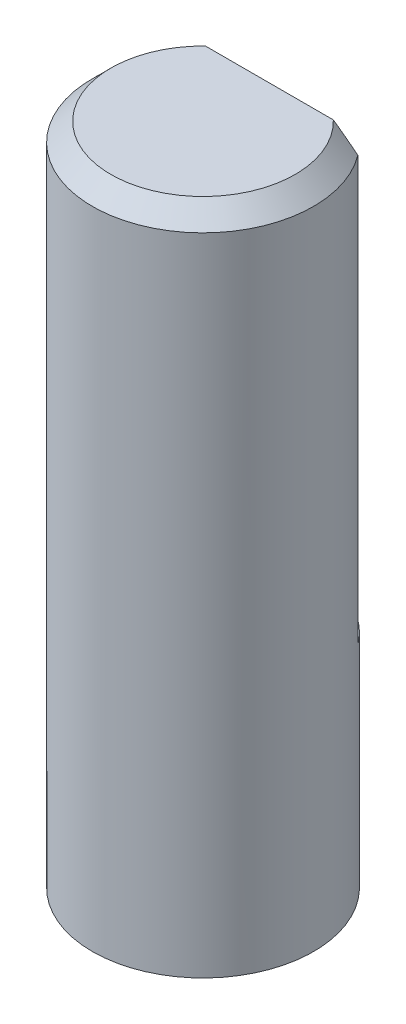
ISO-10303-21;
HEADER;
FILE_DESCRIPTION(('STEP AP214'),'2;1');
FILE_NAME('part.step','',(''),(''),'','','');
FILE_SCHEMA(('AUTOMOTIVE_DESIGN { 1 0 10303 214 1 1 1 1 }'));
ENDSEC;
DATA;
#1=APPLICATION_CONTEXT('core data for automotive mechanical design processes');
#2=APPLICATION_PROTOCOL_DEFINITION('international standard','automotive_design',2000,#1);
#3=PRODUCT_CONTEXT('',#1,'mechanical');
#4=PRODUCT('Part','Part','',(#3));
#5=PRODUCT_RELATED_PRODUCT_CATEGORY('part','',(#4));
#6=PRODUCT_DEFINITION_FORMATION('','',#4);
#7=PRODUCT_DEFINITION_CONTEXT('part definition',#1,'design');
#8=PRODUCT_DEFINITION('design','',#6,#7);
#9=PRODUCT_DEFINITION_SHAPE('','',#8);
#10=(LENGTH_UNIT() NAMED_UNIT(*) SI_UNIT(.MILLI.,.METRE.));
#11=(NAMED_UNIT(*) PLANE_ANGLE_UNIT() SI_UNIT($,.RADIAN.));
#12=(NAMED_UNIT(*) SI_UNIT($,.STERADIAN.) SOLID_ANGLE_UNIT());
#13=UNCERTAINTY_MEASURE_WITH_UNIT(LENGTH_MEASURE(1.E-05),#10,'distance_accuracy_value','');
#14=(GEOMETRIC_REPRESENTATION_CONTEXT(3) GLOBAL_UNCERTAINTY_ASSIGNED_CONTEXT((#13)) GLOBAL_UNIT_ASSIGNED_CONTEXT((#10,
#11,#12)) REPRESENTATION_CONTEXT('',''));
#15=CARTESIAN_POINT('',(0.,0.,0.));
#16=DIRECTION('',(0.,0.,1.));
#17=DIRECTION('',(1.,0.,0.));
#18=AXIS2_PLACEMENT_3D('',#15,#16,#17);
#19=CARTESIAN_POINT('',(0.,18.,0.));
#20=DIRECTION('',(0.,-1.,0.));
#21=DIRECTION('',(0.,0.,-1.));
#22=AXIS2_PLACEMENT_3D('',#19,#20,#21);
#23=CYLINDRICAL_SURFACE('',#22,3.);
#24=CARTESIAN_POINT('',(0.,17.5,0.));
#25=DIRECTION('',(0.,1.,0.));
#26=DIRECTION('',(0.,0.,1.));
#27=AXIS2_PLACEMENT_3D('',#24,#25,#26);
#28=CIRCLE('',#27,3.);
#29=CARTESIAN_POINT('',(2.4,17.5,-1.8));
#30=VERTEX_POINT('',#29);
#31=CARTESIAN_POINT('',(-2.4,17.5,-1.8));
#32=VERTEX_POINT('',#31);
#33=EDGE_CURVE('E95',#30,#32,#28,.F.);
#34=ORIENTED_EDGE('',*,*,#33,.T.);
#35=DIRECTION('',(0.,1.,0.));
#36=VECTOR('',#35,1.);
#37=CARTESIAN_POINT('',(-2.4,6.,-1.8));
#38=LINE('',#37,#36);
#39=CARTESIAN_POINT('',(-2.4,6.,-1.8));
#40=VERTEX_POINT('',#39);
#41=EDGE_CURVE('E60',#40,#32,#38,.T.);
#42=ORIENTED_EDGE('',*,*,#41,.F.);
#43=CARTESIAN_POINT('',(0.,6.,0.));
#44=DIRECTION('',(0.,1.,0.));
#45=DIRECTION('',(0.,0.,1.));
#46=AXIS2_PLACEMENT_3D('',#43,#44,#45);
#47=CIRCLE('',#46,3.);
#48=CARTESIAN_POINT('',(2.4,6.,-1.8));
#49=VERTEX_POINT('',#48);
#50=EDGE_CURVE('E80',#49,#40,#47,.T.);
#51=ORIENTED_EDGE('',*,*,#50,.F.);
#52=DIRECTION('',(0.,1.,0.));
#53=VECTOR('',#52,1.);
#54=CARTESIAN_POINT('',(2.4,6.,-1.8));
#55=LINE('',#54,#53);
#56=EDGE_CURVE('E71',#49,#30,#55,.T.);
#57=ORIENTED_EDGE('',*,*,#56,.T.);
#58=EDGE_LOOP('',(#34,#42,#51,#57));
#59=FACE_BOUND('',#58,.T.);
#60=CARTESIAN_POINT('',(0.,0.,0.));
#61=DIRECTION('',(0.,1.,0.));
#62=DIRECTION('',(0.,0.,1.));
#63=AXIS2_PLACEMENT_3D('',#60,#61,#62);
#64=CIRCLE('',#63,3.);
#65=CARTESIAN_POINT('',(0.,0.,3.));
#66=VERTEX_POINT('',#65);
#67=EDGE_CURVE('E89',#66,#66,#64,.T.);
#68=ORIENTED_EDGE('',*,*,#67,.T.);
#69=EDGE_LOOP('',(#68));
#70=FACE_BOUND('',#69,.T.);
#71=ADVANCED_FACE('F34',(#59,#70),#23,.T.);
#72=CARTESIAN_POINT('',(0.,18.,0.));
#73=DIRECTION('',(0.,1.,0.));
#74=DIRECTION('',(0.,0.,1.));
#75=AXIS2_PLACEMENT_3D('',#72,#73,#74);
#76=PLANE('',#75);
#77=DIRECTION('',(1.,0.,0.));
#78=VECTOR('',#77,1.);
#79=CARTESIAN_POINT('',(-2.4,18.,-1.8));
#80=LINE('',#79,#78);
#81=CARTESIAN_POINT('',(-1.73493515728975,18.,-1.8));
#82=VERTEX_POINT('',#81);
#83=CARTESIAN_POINT('',(1.73493515728975,18.,-1.8));
#84=VERTEX_POINT('',#83);
#85=EDGE_CURVE('E54',#82,#84,#80,.T.);
#86=ORIENTED_EDGE('',*,*,#85,.F.);
#87=CARTESIAN_POINT('',(0.,18.,0.));
#88=DIRECTION('',(0.,1.,0.));
#89=DIRECTION('',(0.,0.,1.));
#90=AXIS2_PLACEMENT_3D('',#87,#88,#89);
#91=CIRCLE('',#90,2.5);
#92=EDGE_CURVE('E93',#82,#84,#91,.T.);
#93=ORIENTED_EDGE('',*,*,#92,.T.);
#94=EDGE_LOOP('',(#86,#93));
#95=FACE_BOUND('',#94,.T.);
#96=ADVANCED_FACE('F99',(#95),#76,.T.);
#97=CARTESIAN_POINT('',(0.,0.,0.));
#98=DIRECTION('',(0.,1.,0.));
#99=DIRECTION('',(0.,0.,1.));
#100=AXIS2_PLACEMENT_3D('',#97,#98,#99);
#101=PLANE('',#100);
#102=ORIENTED_EDGE('',*,*,#67,.F.);
#103=EDGE_LOOP('',(#102));
#104=FACE_BOUND('',#103,.T.);
#105=ADVANCED_FACE('F101',(#104),#101,.F.);
#106=CARTESIAN_POINT('',(0.,18.,0.));
#107=DIRECTION('',(0.,-1.,0.));
#108=DIRECTION('',(0.,0.,-1.));
#109=AXIS2_PLACEMENT_3D('',#106,#107,#108);
#110=CONICAL_SURFACE('',#109,2.5,0.785398163397448);
#111=CARTESIAN_POINT('',(-5.29578284288328,14.9066721963596,-1.8));
#112=CARTESIAN_POINT('',(-5.12285180266291,15.0703540126584,-1.8));
#113=CARTESIAN_POINT('',(-4.94955019645599,15.2336504095275,-1.8));
#114=CARTESIAN_POINT('',(-4.60162438118305,15.5592473838574,-1.8));
#115=CARTESIAN_POINT('',(-4.42699883391852,15.7215465302245,-1.8));
#116=CARTESIAN_POINT('',(-4.06851224534989,16.0516608721901,-1.8));
#117=CARTESIAN_POINT('',(-3.88458392141662,16.2194031296405,-1.8));
#118=CARTESIAN_POINT('',(-3.51459877302508,16.552115561214,-1.8));
#119=CARTESIAN_POINT('',(-3.3285445876314,16.7170886526615,-1.8));
#120=CARTESIAN_POINT('',(-3.0469552865494,16.9613852102644,-1.8));
#121=CARTESIAN_POINT('',(-2.95274357195754,17.0422325960205,-1.8));
#122=CARTESIAN_POINT('',(-2.76320922654278,17.2026126022802,-1.8));
#123=CARTESIAN_POINT('',(-2.66788662596549,17.2821452584374,-1.8));
#124=CARTESIAN_POINT('',(-2.47547651174436,17.4397830383105,-1.8));
#125=CARTESIAN_POINT('',(-2.37838379128246,17.5178818262759,-1.8));
#126=CARTESIAN_POINT('',(-2.18237585089865,17.6717370747434,-1.8));
#127=CARTESIAN_POINT('',(-2.08346092711413,17.7474939105837,-1.8));
#128=CARTESIAN_POINT('',(-1.88532169174342,17.894219628657,-1.8));
#129=CARTESIAN_POINT('',(-1.78614736284381,17.9652556001344,-1.8));
#130=CARTESIAN_POINT('',(-1.5846683568887,18.1029700141344,-1.8));
#131=CARTESIAN_POINT('',(-1.48236132429949,18.1696450532922,-1.8));
#132=CARTESIAN_POINT('',(-1.27439518990201,18.2960736980376,-1.8));
#133=CARTESIAN_POINT('',(-1.1687613448564,18.355868364682,-1.8));
#134=CARTESIAN_POINT('',(-0.952556163795937,18.4656166003948,-1.8));
#135=CARTESIAN_POINT('',(-0.841995054764684,18.5155894860828,-1.8));
#136=CARTESIAN_POINT('',(-0.67571400546358,18.5779707744145,-1.8));
#137=CARTESIAN_POINT('',(-0.622180982305442,18.5962022888381,-1.8));
#138=CARTESIAN_POINT('',(-0.513910266480796,18.6287873383075,-1.8));
#139=CARTESIAN_POINT('',(-0.459172176697258,18.6431395736471,-1.8));
#140=CARTESIAN_POINT('',(-0.348992821062411,18.6672628138493,-1.8));
#141=CARTESIAN_POINT('',(-0.293556967868144,18.6770582049487,-1.8));
#142=CARTESIAN_POINT('',(-0.182034692593678,18.6916627606029,-1.8));
#143=CARTESIAN_POINT('',(-0.125948428950475,18.6964731147207,-1.8));
#144=CARTESIAN_POINT('',(-0.0132008668996252,18.7008386657294,-1.8));
#145=CARTESIAN_POINT('',(0.0434617950341464,18.7003593453081,-1.8));
#146=CARTESIAN_POINT('',(0.15648774149834,18.6940921780968,-1.8));
#147=CARTESIAN_POINT('',(0.212851022487892,18.6883042686605,-1.8));
#148=CARTESIAN_POINT('',(0.325096233526428,18.671724967809,-1.8));
#149=CARTESIAN_POINT('',(0.380974656979358,18.6609101918883,-1.8));
#150=CARTESIAN_POINT('',(0.491676832762132,18.6348327137508,-1.8));
#151=CARTESIAN_POINT('',(0.54650036964537,18.6195691129868,-1.8));
#152=CARTESIAN_POINT('',(0.688019766423603,18.5747703856724,-1.8));
#153=CARTESIAN_POINT('',(0.773755994279863,18.5422094516917,-1.8));
#154=CARTESIAN_POINT('',(0.942080002539032,18.4697969263594,-1.8));
#155=CARTESIAN_POINT('',(1.02466506086554,18.4299391967279,-1.8));
#156=CARTESIAN_POINT('',(1.18780091303287,18.3445424570655,-1.8));
#157=CARTESIAN_POINT('',(1.26832535988246,18.2989536643178,-1.8));
#158=CARTESIAN_POINT('',(1.38730526076978,18.2276412203138,-1.8));
#159=CARTESIAN_POINT('',(1.42665708647506,18.2033868873823,-1.8));
#160=CARTESIAN_POINT('',(1.50482372835086,18.15402980513,-1.8));
#161=CARTESIAN_POINT('',(1.54363856520485,18.1289270886157,-1.8));
#162=CARTESIAN_POINT('',(1.67182501563615,18.0443017298246,-1.8));
#163=CARTESIAN_POINT('',(1.76014213154034,17.9831809982279,-1.8));
#164=CARTESIAN_POINT('',(1.93475691237975,17.8581099630329,-1.8));
#165=CARTESIAN_POINT('',(2.02105414744676,17.7941590653449,-1.8));
#166=CARTESIAN_POINT('',(2.19210447719125,17.6641168712498,-1.8));
#167=CARTESIAN_POINT('',(2.2768565264644,17.5980242040805,-1.8));
#168=CARTESIAN_POINT('',(2.44508801948856,17.4642354600927,-1.8));
#169=CARTESIAN_POINT('',(2.52856739356204,17.3965392959989,-1.8));
#170=CARTESIAN_POINT('',(2.77799047736409,17.1911877411021,-1.8));
#171=CARTESIAN_POINT('',(2.94240007196368,17.0516713782478,-1.8));
#172=CARTESIAN_POINT('',(3.26843637260826,16.7695759942704,-1.8));
#173=CARTESIAN_POINT('',(3.43006413095913,16.6269981792333,-1.8));
#174=CARTESIAN_POINT('',(3.73546723091933,16.3539753142177,-1.8));
#175=CARTESIAN_POINT('',(3.87942213606178,16.2237307458772,-1.8));
#176=CARTESIAN_POINT('',(4.16619516720294,15.9619650961217,-1.8));
#177=CARTESIAN_POINT('',(4.30901315898711,15.830443867946,-1.8));
#178=CARTESIAN_POINT('',(4.59288247936315,15.5672779669628,-1.8));
#179=CARTESIAN_POINT('',(4.73393927099943,15.4356391790714,-1.8));
#180=CARTESIAN_POINT('',(5.0153431952258,15.1716466142537,-1.8));
#181=CARTESIAN_POINT('',(5.15569042994564,15.0392929462436,-1.8));
#182=CARTESIAN_POINT('',(5.29578284288328,14.9066721963596,-1.8));
#183=B_SPLINE_CURVE_WITH_KNOTS('',3,(#111,#112,#113,#114,#115,#116,#117,#118,#119,#120,#121,
#122,#123,#124,#125,#126,#127,#128,#129,#130,#131,#132,#133,#134,#135,#136,#137,#138,#139,#140,
#141,#142,#143,#144,#145,#146,#147,#148,#149,#150,#151,#152,#153,#154,#155,#156,#157,#158,#159,
#160,#161,#162,#163,#164,#165,#166,#167,#168,#169,#170,#171,#172,#173,#174,#175,#176,#177,#178,
#179,#180,#181,#182),.UNSPECIFIED.,.F.,.F.,(4,2,2,2,2,2,2,2,2,2,2,2,2,2,2,2,2,2,2,2,2,2,2,2,2,2,
2,2,2,2,2,2,2,2,2,4),(0.,0.714339121129969,1.4295359451444,2.17631800258365,2.92225648956363,
3.29468470304652,3.66710280016944,4.04089238896473,4.4146217576662,4.7805141986725,
5.14668886423431,5.51055046501753,5.8736891319736,6.04322842397081,6.21282444787905,
6.38150212030355,6.55013953245812,6.71987802063261,6.88961851190608,7.06015664612701,
7.23072924851931,7.50536044755127,7.7802237450112,8.05766521368626,8.19633537101629,
8.33500017216291,8.65712483021718,8.9793174302738,9.30172047707967,9.62414111215304,
10.2709512389679,10.9175110620876,11.4998923501344,12.0823413989977,12.6611581113517,
13.2398889942293),.UNSPECIFIED.);
#184=EDGE_CURVE('E11',#32,#82,#183,.T.);
#185=ORIENTED_EDGE('',*,*,#184,.F.);
#186=ORIENTED_EDGE('',*,*,#33,.F.);
#187=EDGE_CURVE('E39',#84,#30,#183,.T.);
#188=ORIENTED_EDGE('',*,*,#187,.F.);
#189=ORIENTED_EDGE('',*,*,#92,.F.);
#190=EDGE_LOOP('',(#185,#186,#188,#189));
#191=FACE_BOUND('',#190,.T.);
#192=ADVANCED_FACE('F36',(#191),#110,.T.);
#193=CARTESIAN_POINT('',(-2.4,6.,-1.8));
#194=DIRECTION('',(0.,0.,1.));
#195=DIRECTION('',(1.,0.,0.));
#196=AXIS2_PLACEMENT_3D('',#193,#194,#195);
#197=PLANE('',#196);
#198=ORIENTED_EDGE('',*,*,#184,.T.);
#199=ORIENTED_EDGE('',*,*,#85,.T.);
#200=ORIENTED_EDGE('',*,*,#187,.T.);
#201=ORIENTED_EDGE('',*,*,#56,.F.);
#202=DIRECTION('',(1.,0.,0.));
#203=VECTOR('',#202,1.);
#204=CARTESIAN_POINT('',(-2.4,6.,-1.8));
#205=LINE('',#204,#203);
#206=EDGE_CURVE('E74',#40,#49,#205,.T.);
#207=ORIENTED_EDGE('',*,*,#206,.F.);
#208=ORIENTED_EDGE('',*,*,#41,.T.);
#209=EDGE_LOOP('',(#198,#199,#200,#201,#207,#208));
#210=FACE_BOUND('',#209,.T.);
#211=ADVANCED_FACE('F73',(#210),#197,.F.);
#212=CARTESIAN_POINT('',(0.,6.,0.));
#213=DIRECTION('',(0.,1.,0.));
#214=DIRECTION('',(0.,0.,1.));
#215=AXIS2_PLACEMENT_3D('',#212,#213,#214);
#216=PLANE('',#215);
#217=ORIENTED_EDGE('',*,*,#206,.T.);
#218=ORIENTED_EDGE('',*,*,#50,.T.);
#219=EDGE_LOOP('',(#217,#218));
#220=FACE_BOUND('',#219,.T.);
#221=ADVANCED_FACE('F83',(#220),#216,.T.);
#222=CLOSED_SHELL('',(#71,#96,#105,#192,#211,#221));
#223=MANIFOLD_SOLID_BREP('B2',#222);
#224=ADVANCED_BREP_SHAPE_REPRESENTATION('',(#18,#223),#14);
#225=SHAPE_DEFINITION_REPRESENTATION(#9,#224);
ENDSEC;
END-ISO-10303-21;
